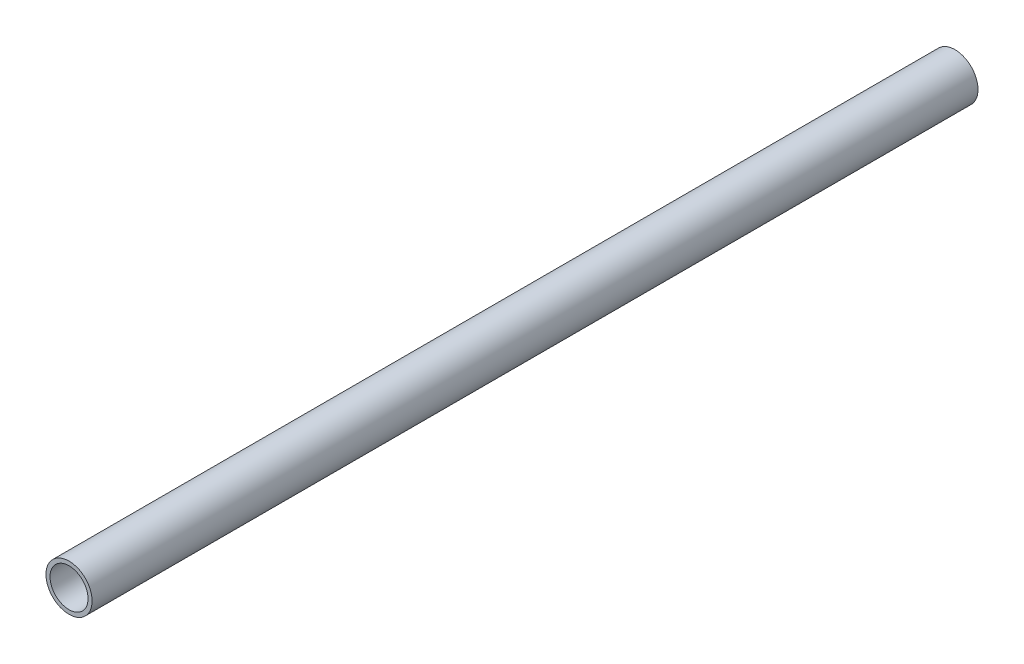
ISO-10303-21;
HEADER;
FILE_DESCRIPTION(('STEP AP214'),'2;1');
FILE_NAME('part.step','',(''),(''),'','','');
FILE_SCHEMA(('AUTOMOTIVE_DESIGN { 1 0 10303 214 1 1 1 1 }'));
ENDSEC;
DATA;
#1=APPLICATION_CONTEXT('core data for automotive mechanical design processes');
#2=APPLICATION_PROTOCOL_DEFINITION('international standard','automotive_design',2000,#1);
#3=PRODUCT_CONTEXT('',#1,'mechanical');
#4=PRODUCT('Part','Part','',(#3));
#5=PRODUCT_RELATED_PRODUCT_CATEGORY('part','',(#4));
#6=PRODUCT_DEFINITION_FORMATION('','',#4);
#7=PRODUCT_DEFINITION_CONTEXT('part definition',#1,'design');
#8=PRODUCT_DEFINITION('design','',#6,#7);
#9=PRODUCT_DEFINITION_SHAPE('','',#8);
#10=(LENGTH_UNIT() NAMED_UNIT(*) SI_UNIT(.MILLI.,.METRE.));
#11=(NAMED_UNIT(*) PLANE_ANGLE_UNIT() SI_UNIT($,.RADIAN.));
#12=(NAMED_UNIT(*) SI_UNIT($,.STERADIAN.) SOLID_ANGLE_UNIT());
#13=UNCERTAINTY_MEASURE_WITH_UNIT(LENGTH_MEASURE(1.E-05),#10,'distance_accuracy_value','');
#14=(GEOMETRIC_REPRESENTATION_CONTEXT(3) GLOBAL_UNCERTAINTY_ASSIGNED_CONTEXT((#13)) GLOBAL_UNIT_ASSIGNED_CONTEXT((#10,
#11,#12)) REPRESENTATION_CONTEXT('',''));
#15=CARTESIAN_POINT('',(0.,0.,0.));
#16=DIRECTION('',(0.,0.,1.));
#17=DIRECTION('',(1.,0.,0.));
#18=AXIS2_PLACEMENT_3D('',#15,#16,#17);
#19=CARTESIAN_POINT('',(0.,0.,609.6));
#20=DIRECTION('',(0.,0.,1.));
#21=DIRECTION('',(1.,0.,0.));
#22=AXIS2_PLACEMENT_3D('',#19,#20,#21);
#23=PLANE('',#22);
#24=CARTESIAN_POINT('',(0.,0.,609.6));
#25=DIRECTION('',(0.,0.,1.));
#26=DIRECTION('',(1.,0.,0.));
#27=AXIS2_PLACEMENT_3D('',#24,#25,#26);
#28=CIRCLE('',#27,15.875);
#29=CARTESIAN_POINT('',(15.875,0.,609.6));
#30=VERTEX_POINT('',#29);
#31=EDGE_CURVE('E10',#30,#30,#28,.T.);
#32=ORIENTED_EDGE('',*,*,#31,.T.);
#33=EDGE_LOOP('',(#32));
#34=FACE_BOUND('',#33,.T.);
#35=CARTESIAN_POINT('',(0.,0.,609.6));
#36=DIRECTION('',(0.,0.,1.));
#37=DIRECTION('',(1.,0.,0.));
#38=AXIS2_PLACEMENT_3D('',#35,#36,#37);
#39=CIRCLE('',#38,13.081);
#40=CARTESIAN_POINT('',(13.081,0.,609.6));
#41=VERTEX_POINT('',#40);
#42=EDGE_CURVE('E42',#41,#41,#39,.T.);
#43=ORIENTED_EDGE('',*,*,#42,.F.);
#44=EDGE_LOOP('',(#43));
#45=FACE_BOUND('',#44,.T.);
#46=ADVANCED_FACE('F31',(#34,#45),#23,.T.);
#47=CARTESIAN_POINT('',(0.,0.,0.));
#48=DIRECTION('',(0.,0.,1.));
#49=DIRECTION('',(1.,0.,0.));
#50=AXIS2_PLACEMENT_3D('',#47,#48,#49);
#51=PLANE('',#50);
#52=CARTESIAN_POINT('',(0.,0.,0.));
#53=DIRECTION('',(0.,0.,1.));
#54=DIRECTION('',(1.,0.,0.));
#55=AXIS2_PLACEMENT_3D('',#52,#53,#54);
#56=CIRCLE('',#55,15.875);
#57=CARTESIAN_POINT('',(15.875,0.,0.));
#58=VERTEX_POINT('',#57);
#59=EDGE_CURVE('E35',#58,#58,#56,.T.);
#60=ORIENTED_EDGE('',*,*,#59,.F.);
#61=EDGE_LOOP('',(#60));
#62=FACE_BOUND('',#61,.T.);
#63=CARTESIAN_POINT('',(0.,0.,0.));
#64=DIRECTION('',(0.,0.,1.));
#65=DIRECTION('',(1.,0.,0.));
#66=AXIS2_PLACEMENT_3D('',#63,#64,#65);
#67=CIRCLE('',#66,13.081);
#68=CARTESIAN_POINT('',(13.081,0.,0.));
#69=VERTEX_POINT('',#68);
#70=EDGE_CURVE('E44',#69,#69,#67,.T.);
#71=ORIENTED_EDGE('',*,*,#70,.T.);
#72=EDGE_LOOP('',(#71));
#73=FACE_BOUND('',#72,.T.);
#74=ADVANCED_FACE('F54',(#62,#73),#51,.F.);
#75=CARTESIAN_POINT('',(0.,0.,609.6));
#76=DIRECTION('',(0.,0.,-1.));
#77=DIRECTION('',(-1.,0.,0.));
#78=AXIS2_PLACEMENT_3D('',#75,#76,#77);
#79=CYLINDRICAL_SURFACE('',#78,15.875);
#80=ORIENTED_EDGE('',*,*,#31,.F.);
#81=EDGE_LOOP('',(#80));
#82=FACE_BOUND('',#81,.T.);
#83=ORIENTED_EDGE('',*,*,#59,.T.);
#84=EDGE_LOOP('',(#83));
#85=FACE_BOUND('',#84,.T.);
#86=ADVANCED_FACE('F33',(#82,#85),#79,.T.);
#87=CARTESIAN_POINT('',(0.,0.,609.6));
#88=DIRECTION('',(0.,0.,-1.));
#89=DIRECTION('',(-1.,0.,0.));
#90=AXIS2_PLACEMENT_3D('',#87,#88,#89);
#91=CYLINDRICAL_SURFACE('',#90,13.081);
#92=ORIENTED_EDGE('',*,*,#42,.T.);
#93=EDGE_LOOP('',(#92));
#94=FACE_BOUND('',#93,.T.);
#95=ORIENTED_EDGE('',*,*,#70,.F.);
#96=EDGE_LOOP('',(#95));
#97=FACE_BOUND('',#96,.T.);
#98=ADVANCED_FACE('F50',(#94,#97),#91,.F.);
#99=CLOSED_SHELL('',(#46,#74,#86,#98));
#100=MANIFOLD_SOLID_BREP('B2',#99);
#101=ADVANCED_BREP_SHAPE_REPRESENTATION('',(#18,#100),#14);
#102=SHAPE_DEFINITION_REPRESENTATION(#9,#101);
ENDSEC;
END-ISO-10303-21;
